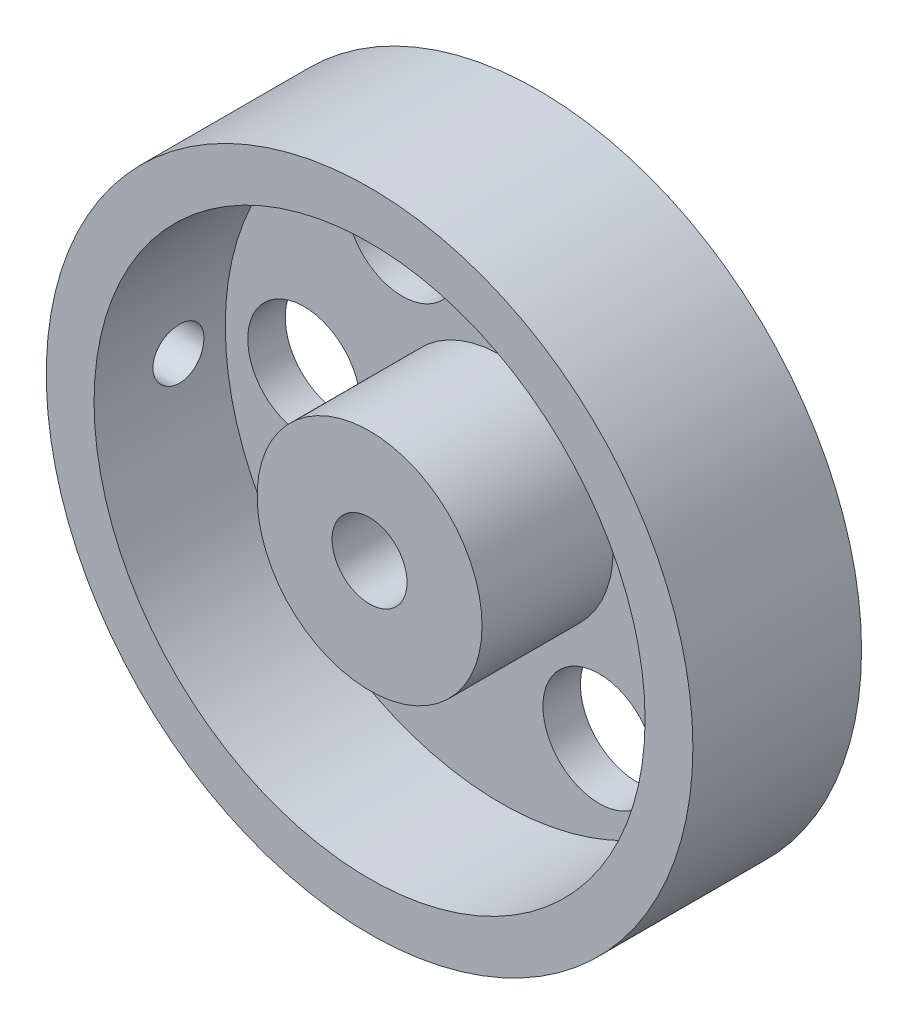
ISO-10303-21;
HEADER;
FILE_DESCRIPTION(('STEP AP214'),'2;1');
FILE_NAME('part.step','',(''),(''),'','','');
FILE_SCHEMA(('AUTOMOTIVE_DESIGN { 1 0 10303 214 1 1 1 1 }'));
ENDSEC;
DATA;
#1=APPLICATION_CONTEXT('core data for automotive mechanical design processes');
#2=APPLICATION_PROTOCOL_DEFINITION('international standard','automotive_design',2000,#1);
#3=PRODUCT_CONTEXT('',#1,'mechanical');
#4=PRODUCT('Part','Part','',(#3));
#5=PRODUCT_RELATED_PRODUCT_CATEGORY('part','',(#4));
#6=PRODUCT_DEFINITION_FORMATION('','',#4);
#7=PRODUCT_DEFINITION_CONTEXT('part definition',#1,'design');
#8=PRODUCT_DEFINITION('design','',#6,#7);
#9=PRODUCT_DEFINITION_SHAPE('','',#8);
#10=(LENGTH_UNIT() NAMED_UNIT(*) SI_UNIT(.MILLI.,.METRE.));
#11=(NAMED_UNIT(*) PLANE_ANGLE_UNIT() SI_UNIT($,.RADIAN.));
#12=(NAMED_UNIT(*) SI_UNIT($,.STERADIAN.) SOLID_ANGLE_UNIT());
#13=UNCERTAINTY_MEASURE_WITH_UNIT(LENGTH_MEASURE(1.E-05),#10,'distance_accuracy_value','');
#14=(GEOMETRIC_REPRESENTATION_CONTEXT(3) GLOBAL_UNCERTAINTY_ASSIGNED_CONTEXT((#13)) GLOBAL_UNIT_ASSIGNED_CONTEXT((#10,
#11,#12)) REPRESENTATION_CONTEXT('',''));
#15=CARTESIAN_POINT('',(0.,0.,0.));
#16=DIRECTION('',(0.,0.,1.));
#17=DIRECTION('',(1.,0.,0.));
#18=AXIS2_PLACEMENT_3D('',#15,#16,#17);
#19=CARTESIAN_POINT('',(0.,0.,4.5));
#20=DIRECTION('',(0.,0.,1.));
#21=DIRECTION('',(1.,0.,0.));
#22=AXIS2_PLACEMENT_3D('',#19,#20,#21);
#23=PLANE('',#22);
#24=CARTESIAN_POINT('',(0.,0.,4.5));
#25=DIRECTION('',(0.,0.,1.));
#26=DIRECTION('',(1.,0.,0.));
#27=AXIS2_PLACEMENT_3D('',#24,#25,#26);
#28=CIRCLE('',#27,2.);
#29=CARTESIAN_POINT('',(2.,0.,4.5));
#30=VERTEX_POINT('',#29);
#31=EDGE_CURVE('E52',#30,#30,#28,.T.);
#32=ORIENTED_EDGE('',*,*,#31,.F.);
#33=EDGE_LOOP('',(#32));
#34=FACE_BOUND('',#33,.T.);
#35=CARTESIAN_POINT('',(0.,0.,4.5));
#36=DIRECTION('',(0.,0.,1.));
#37=DIRECTION('',(1.,0.,0.));
#38=AXIS2_PLACEMENT_3D('',#35,#36,#37);
#39=CIRCLE('',#38,6.);
#40=CARTESIAN_POINT('',(6.,0.,4.5));
#41=VERTEX_POINT('',#40);
#42=EDGE_CURVE('E64',#41,#41,#39,.T.);
#43=ORIENTED_EDGE('',*,*,#42,.T.);
#44=EDGE_LOOP('',(#43));
#45=FACE_BOUND('',#44,.T.);
#46=ADVANCED_FACE('F31',(#34,#45),#23,.T.);
#47=CARTESIAN_POINT('',(0.,0.,4.5));
#48=DIRECTION('',(0.,0.,-1.));
#49=DIRECTION('',(-1.,0.,0.));
#50=AXIS2_PLACEMENT_3D('',#47,#48,#49);
#51=CYLINDRICAL_SURFACE('',#50,17.25);
#52=CARTESIAN_POINT('',(-17.25,0.,1.35933312987779));
#53=CARTESIAN_POINT('',(-17.2499992957602,-0.0762274641774041,1.35932979417059));
#54=CARTESIAN_POINT('',(-17.2494893375577,-0.152507179399383,1.35289964419755));
#55=CARTESIAN_POINT('',(-17.2475040430068,-0.302957131739326,1.327342605069));
#56=CARTESIAN_POINT('',(-17.2460276057452,-0.377124862444516,1.30820123624382));
#57=CARTESIAN_POINT('',(-17.242276241251,-0.521150016364087,1.25777781248264));
#58=CARTESIAN_POINT('',(-17.2400017585159,-0.591009813606863,1.22650251490897));
#59=CARTESIAN_POINT('',(-17.2349095538675,-0.724471087288447,1.1527108490239));
#60=CARTESIAN_POINT('',(-17.2320919501703,-0.788073921080153,1.11019692617242));
#61=CARTESIAN_POINT('',(-17.2262225740768,-0.907378876379137,1.01502919501065));
#62=CARTESIAN_POINT('',(-17.2231703372412,-0.963064672135179,0.962354947138997));
#63=CARTESIAN_POINT('',(-17.2171796127248,-1.06481484378408,0.848404810772238));
#64=CARTESIAN_POINT('',(-17.2142411299849,-1.11087880213141,0.787128549180346));
#65=CARTESIAN_POINT('',(-17.2088055219121,-1.19213210115538,0.657616072063306));
#66=CARTESIAN_POINT('',(-17.2063089750258,-1.22730723393552,0.589370916456741));
#67=CARTESIAN_POINT('',(-17.2020450508998,-1.28569360838048,0.447920266605859));
#68=CARTESIAN_POINT('',(-17.2002776620052,-1.30890504127662,0.374714851668963));
#69=CARTESIAN_POINT('',(-17.1976759503448,-1.34265813373688,0.225584229255765));
#70=CARTESIAN_POINT('',(-17.1968396818036,-1.35322621774692,0.149665036988275));
#71=CARTESIAN_POINT('',(-17.1961887021736,-1.36147424260213,-0.00287388425774297));
#72=CARTESIAN_POINT('',(-17.1963739737542,-1.35915440209354,-0.0794936013297088));
#73=CARTESIAN_POINT('',(-17.1977433769619,-1.34171428665528,-0.231077785869114));
#74=CARTESIAN_POINT('',(-17.1989252699997,-1.32662269907245,-0.30604557692854));
#75=CARTESIAN_POINT('',(-17.2021512269936,-1.28411203591114,-0.452380672278425));
#76=CARTESIAN_POINT('',(-17.2041952985876,-1.256692851125,-0.523747944666397));
#77=CARTESIAN_POINT('',(-17.2089178655337,-1.19027309517235,-0.660947753404041));
#78=CARTESIAN_POINT('',(-17.2115970671521,-1.15125961878549,-0.72677401691549));
#79=CARTESIAN_POINT('',(-17.2172873400081,-1.06276804217602,-0.850954650643922));
#80=CARTESIAN_POINT('',(-17.2202984172447,-1.01328975277884,-0.909308885756894));
#81=CARTESIAN_POINT('',(-17.2263231110799,-0.90511199551655,-1.01705582702473));
#82=CARTESIAN_POINT('',(-17.229336712167,-0.846387720784704,-1.06642363142459));
#83=CARTESIAN_POINT('',(-17.235019036056,-0.72147160410892,-1.15460391664355));
#84=CARTESIAN_POINT('',(-17.2376877586584,-0.655279757840774,-1.1934163913504));
#85=CARTESIAN_POINT('',(-17.2423800575149,-0.517291515521989,-1.25938258957727));
#86=CARTESIAN_POINT('',(-17.2444035748714,-0.44549460855685,-1.28653524880777));
#87=CARTESIAN_POINT('',(-17.2475767648891,-0.298341557836255,-1.32839381132144));
#88=CARTESIAN_POINT('',(-17.2487264537661,-0.222985480156663,-1.34309994557803));
#89=CARTESIAN_POINT('',(-17.2500203636614,-0.0710690644728022,-1.35961687240942));
#90=CARTESIAN_POINT('',(-17.2501672671709,0.00548751115963325,-1.36146206878935));
#91=CARTESIAN_POINT('',(-17.2494462113906,0.157821490063054,-1.35229481089871));
#92=CARTESIAN_POINT('',(-17.2485782605519,0.233598899817141,-1.34128246369767));
#93=CARTESIAN_POINT('',(-17.2459268558467,0.382125693739451,-1.30674122685946));
#94=CARTESIAN_POINT('',(-17.244144565613,0.454878799869758,-1.28322824475954));
#95=CARTESIAN_POINT('',(-17.2398647686895,0.59540698654869,-1.22436941012586));
#96=CARTESIAN_POINT('',(-17.2373672518548,0.663181996470341,-1.18902338974984));
#97=CARTESIAN_POINT('',(-17.2319304417961,0.791986911580763,-1.10741509336683));
#98=CARTESIAN_POINT('',(-17.2289902291071,0.85300230835645,-1.06112998047423));
#99=CARTESIAN_POINT('',(-17.2230015881174,0.966409637753478,-0.958990412544724));
#100=CARTESIAN_POINT('',(-17.2199531581356,1.01880143634707,-0.903135808806561));
#101=CARTESIAN_POINT('',(-17.2140837559855,1.11359201659709,-0.783293680276474));
#102=CARTESIAN_POINT('',(-17.2112633032414,1.15596837914113,-0.719288393866536));
#103=CARTESIAN_POINT('',(-17.2061763666753,1.22937154931333,-0.585050387914116));
#104=CARTESIAN_POINT('',(-17.2039098778265,1.26039845993042,-0.514817724888232));
#105=CARTESIAN_POINT('',(-17.2001902796655,1.31018364224473,-0.370198600142288));
#106=CARTESIAN_POINT('',(-17.1987362545834,1.32895573101892,-0.295816919467276));
#107=CARTESIAN_POINT('',(-17.1968030678176,1.35374341932557,-0.144945488959267));
#108=CARTESIAN_POINT('',(-17.1963238896128,1.35975923504184,-0.0684557748739048));
#109=CARTESIAN_POINT('',(-17.1963948571571,1.35886122525985,0.0842376466537328));
#110=CARTESIAN_POINT('',(-17.1969421983353,1.35198262882585,0.160441565068851));
#111=CARTESIAN_POINT('',(-17.1989985774396,1.32556441236062,0.310608404857035));
#112=CARTESIAN_POINT('',(-17.2005076169089,1.30602477201057,0.384571322633475));
#113=CARTESIAN_POINT('',(-17.2043166303647,1.25484783603023,0.528159589144891));
#114=CARTESIAN_POINT('',(-17.2066165697778,1.2232110692046,0.597785127326117));
#115=CARTESIAN_POINT('',(-17.2117482744468,1.14874202042727,0.730742167281753));
#116=CARTESIAN_POINT('',(-17.2145800300505,1.10590994166072,0.794073783256578));
#117=CARTESIAN_POINT('',(-17.2204654643286,1.01013395721175,0.912825302920152));
#118=CARTESIAN_POINT('',(-17.2235197007625,0.95716405498528,0.968224211919493));
#119=CARTESIAN_POINT('',(-17.2295008984463,0.842661377434269,1.06936618967516));
#120=CARTESIAN_POINT('',(-17.2324278286399,0.781126527908648,1.11510691270317));
#121=CARTESIAN_POINT('',(-17.2378293456297,0.651134042663016,1.19568860292222));
#122=CARTESIAN_POINT('',(-17.2403031513824,0.582664763755367,1.23051082222768));
#123=CARTESIAN_POINT('',(-17.2445102856053,0.440879209639169,1.28812054993251));
#124=CARTESIAN_POINT('',(-17.2462444686903,0.367568642196131,1.31092195530409));
#125=CARTESIAN_POINT('',(-17.2483295231062,0.244851352603883,1.33800682030528));
#126=CARTESIAN_POINT('',(-17.2489531166395,0.196234872498846,1.34599362695821));
#127=CARTESIAN_POINT('',(-17.2497885819731,0.0984195225117546,1.3566578525031));
#128=CARTESIAN_POINT('',(-17.250000454733,0.049220653987309,1.35933528376932));
#129=CARTESIAN_POINT('',(-17.25,0.,1.35933312987779));
#130=B_SPLINE_CURVE_WITH_KNOTS('',3,(#52,#53,#54,#55,#56,#57,#58,#59,#60,#61,#62,#63,#64,#65,
#66,#67,#68,#69,#70,#71,#72,#73,#74,#75,#76,#77,#78,#79,#80,#81,#82,#83,#84,#85,#86,#87,#88,#89,
#90,#91,#92,#93,#94,#95,#96,#97,#98,#99,#100,#101,#102,#103,#104,#105,#106,#107,#108,#109,#110,
#111,#112,#113,#114,#115,#116,#117,#118,#119,#120,#121,#122,#123,#124,#125,#126,#127,#128,#129),
.UNSPECIFIED.,.T.,.F.,(4,2,2,2,2,2,2,2,2,2,2,2,2,2,2,2,2,2,2,2,2,2,2,2,2,2,2,2,2,2,2,2,2,2,2,2,
2,2,4),(0.,0.228502689382628,0.457266119460749,0.685902334056701,0.914488839625479,
1.14354008192695,1.37260126198315,1.60196007667915,1.83131522512208,2.06019018198207,
2.28906125594408,2.51741960986144,2.7457799867987,2.97439550218886,3.20301515066193,
3.4322589769094,3.66150293590459,3.89076781548037,4.12002844043441,4.34867554282929,
4.57732074120864,4.80567567380165,5.03403384556551,5.26287302487969,5.49171576047095,
5.72106599893484,5.95041415614208,6.17950327903521,6.40858851946551,6.63704878387301,
6.8655094149214,7.09396006035558,7.32240655989751,7.55144691266388,7.78054282969696,
8.0100299941685,8.23925126905359,8.38679753920168,8.53434346547173),.UNSPECIFIED.);
#131=CARTESIAN_POINT('',(-17.25,0.,1.35933312987779));
#132=VERTEX_POINT('',#131);
#133=EDGE_CURVE('E105',#132,#132,#130,.T.);
#134=ORIENTED_EDGE('',*,*,#133,.T.);
#135=EDGE_LOOP('',(#134));
#136=FACE_BOUND('',#135,.T.);
#137=CARTESIAN_POINT('',(0.,0.,4.5));
#138=DIRECTION('',(0.,0.,1.));
#139=DIRECTION('',(1.,0.,0.));
#140=AXIS2_PLACEMENT_3D('',#137,#138,#139);
#141=CIRCLE('',#140,17.25);
#142=CARTESIAN_POINT('',(17.25,0.,4.5));
#143=VERTEX_POINT('',#142);
#144=EDGE_CURVE('E10',#143,#143,#141,.T.);
#145=ORIENTED_EDGE('',*,*,#144,.F.);
#146=EDGE_LOOP('',(#145));
#147=FACE_BOUND('',#146,.T.);
#148=CARTESIAN_POINT('',(0.,0.,-4.5));
#149=DIRECTION('',(0.,0.,1.));
#150=DIRECTION('',(1.,0.,0.));
#151=AXIS2_PLACEMENT_3D('',#148,#149,#150);
#152=CIRCLE('',#151,17.25);
#153=CARTESIAN_POINT('',(17.25,0.,-4.5));
#154=VERTEX_POINT('',#153);
#155=EDGE_CURVE('E45',#154,#154,#152,.T.);
#156=ORIENTED_EDGE('',*,*,#155,.T.);
#157=EDGE_LOOP('',(#156));
#158=FACE_BOUND('',#157,.T.);
#159=ADVANCED_FACE('F33',(#136,#147,#158),#51,.T.);
#160=CARTESIAN_POINT('',(0.,0.,4.5));
#161=DIRECTION('',(0.,0.,1.));
#162=DIRECTION('',(1.,0.,0.));
#163=AXIS2_PLACEMENT_3D('',#160,#161,#162);
#164=CIRCLE('',#163,14.7);
#165=CARTESIAN_POINT('',(14.7,0.,4.5));
#166=VERTEX_POINT('',#165);
#167=EDGE_CURVE('E58',#166,#166,#164,.T.);
#168=ORIENTED_EDGE('',*,*,#167,.F.);
#169=EDGE_LOOP('',(#168));
#170=FACE_BOUND('',#169,.T.);
#171=ORIENTED_EDGE('',*,*,#144,.T.);
#172=EDGE_LOOP('',(#171));
#173=FACE_BOUND('',#172,.T.);
#174=ADVANCED_FACE('F146',(#170,#173),#23,.T.);
#175=CARTESIAN_POINT('',(0.,0.,-4.5));
#176=DIRECTION('',(0.,0.,1.));
#177=DIRECTION('',(1.,0.,0.));
#178=AXIS2_PLACEMENT_3D('',#175,#176,#177);
#179=PLANE('',#178);
#180=CARTESIAN_POINT('',(5.24999999999998,-9.09326673973662,-4.5));
#181=DIRECTION('',(0.,0.,1.));
#182=DIRECTION('',(1.,0.,0.));
#183=AXIS2_PLACEMENT_3D('',#180,#181,#182);
#184=CIRCLE('',#183,3.);
#185=CARTESIAN_POINT('',(8.24999999999998,-9.09326673973662,-4.5));
#186=VERTEX_POINT('',#185);
#187=EDGE_CURVE('E75',#186,#186,#184,.F.);
#188=ORIENTED_EDGE('',*,*,#187,.F.);
#189=EDGE_LOOP('',(#188));
#190=FACE_BOUND('',#189,.T.);
#191=CARTESIAN_POINT('',(-5.25000000000004,-9.09326673973658,-4.5));
#192=DIRECTION('',(0.,0.,1.));
#193=DIRECTION('',(1.,0.,0.));
#194=AXIS2_PLACEMENT_3D('',#191,#192,#193);
#195=CIRCLE('',#194,3.);
#196=CARTESIAN_POINT('',(-2.25000000000004,-9.09326673973658,-4.5));
#197=VERTEX_POINT('',#196);
#198=EDGE_CURVE('E90',#197,#197,#195,.F.);
#199=ORIENTED_EDGE('',*,*,#198,.F.);
#200=EDGE_LOOP('',(#199));
#201=FACE_BOUND('',#200,.T.);
#202=CARTESIAN_POINT('',(-10.5,0.,-4.5));
#203=DIRECTION('',(0.,0.,1.));
#204=DIRECTION('',(1.,0.,0.));
#205=AXIS2_PLACEMENT_3D('',#202,#203,#204);
#206=CIRCLE('',#205,3.);
#207=CARTESIAN_POINT('',(-7.5,0.,-4.5));
#208=VERTEX_POINT('',#207);
#209=EDGE_CURVE('E84',#208,#208,#206,.F.);
#210=ORIENTED_EDGE('',*,*,#209,.F.);
#211=EDGE_LOOP('',(#210));
#212=FACE_BOUND('',#211,.T.);
#213=CARTESIAN_POINT('',(-5.24999999999992,9.09326673973665,-4.5));
#214=DIRECTION('',(0.,0.,1.));
#215=DIRECTION('',(1.,0.,0.));
#216=AXIS2_PLACEMENT_3D('',#213,#214,#215);
#217=CIRCLE('',#216,3.);
#218=CARTESIAN_POINT('',(-2.24999999999992,9.09326673973665,-4.5));
#219=VERTEX_POINT('',#218);
#220=EDGE_CURVE('E76',#219,#219,#217,.F.);
#221=ORIENTED_EDGE('',*,*,#220,.F.);
#222=EDGE_LOOP('',(#221));
#223=FACE_BOUND('',#222,.T.);
#224=CARTESIAN_POINT('',(5.25000000000011,9.09326673973655,-4.5));
#225=DIRECTION('',(0.,0.,1.));
#226=DIRECTION('',(1.,0.,0.));
#227=AXIS2_PLACEMENT_3D('',#224,#225,#226);
#228=CIRCLE('',#227,3.);
#229=CARTESIAN_POINT('',(8.2500000000001,9.09326673973655,-4.5));
#230=VERTEX_POINT('',#229);
#231=EDGE_CURVE('E83',#230,#230,#228,.F.);
#232=ORIENTED_EDGE('',*,*,#231,.F.);
#233=EDGE_LOOP('',(#232));
#234=FACE_BOUND('',#233,.T.);
#235=CARTESIAN_POINT('',(10.5,0.,-4.5));
#236=DIRECTION('',(0.,0.,1.));
#237=DIRECTION('',(1.,0.,0.));
#238=AXIS2_PLACEMENT_3D('',#235,#236,#237);
#239=CIRCLE('',#238,3.);
#240=CARTESIAN_POINT('',(13.5,0.,-4.5));
#241=VERTEX_POINT('',#240);
#242=EDGE_CURVE('E67',#241,#241,#239,.F.);
#243=ORIENTED_EDGE('',*,*,#242,.F.);
#244=EDGE_LOOP('',(#243));
#245=FACE_BOUND('',#244,.T.);
#246=CARTESIAN_POINT('',(0.,0.,-4.5));
#247=DIRECTION('',(0.,0.,1.));
#248=DIRECTION('',(1.,0.,0.));
#249=AXIS2_PLACEMENT_3D('',#246,#247,#248);
#250=CIRCLE('',#249,2.);
#251=CARTESIAN_POINT('',(2.,0.,-4.5));
#252=VERTEX_POINT('',#251);
#253=EDGE_CURVE('E50',#252,#252,#250,.T.);
#254=ORIENTED_EDGE('',*,*,#253,.T.);
#255=EDGE_LOOP('',(#254));
#256=FACE_BOUND('',#255,.T.);
#257=ORIENTED_EDGE('',*,*,#155,.F.);
#258=EDGE_LOOP('',(#257));
#259=FACE_BOUND('',#258,.T.);
#260=ADVANCED_FACE('F144',(#190,#201,#212,#223,#234,#245,#256,#259),#179,.F.);
#261=CARTESIAN_POINT('',(0.,0.,-4.5));
#262=DIRECTION('',(0.,0.,1.));
#263=DIRECTION('',(1.,0.,0.));
#264=AXIS2_PLACEMENT_3D('',#261,#262,#263);
#265=CYLINDRICAL_SURFACE('',#264,2.);
#266=CARTESIAN_POINT('',(-2.,0.,-1.35933312987779));
#267=CARTESIAN_POINT('',(-1.99999850436739,-0.0680042378719131,-1.35933160545136));
#268=CARTESIAN_POINT('',(-1.99650055032291,-0.136022646043432,-1.35420007943743));
#269=CARTESIAN_POINT('',(-1.98285056613965,-0.26988954315332,-1.3339929079033));
#270=CARTESIAN_POINT('',(-1.97269392570533,-0.335736495433287,-1.31891037252554));
#271=CARTESIAN_POINT('',(-1.94672510082895,-0.46310926435366,-1.27974153745011));
#272=CARTESIAN_POINT('',(-1.93094049464692,-0.524654431977787,-1.25569911761041));
#273=CARTESIAN_POINT('',(-1.89497041174998,-0.64256694272928,-1.19965024561961));
#274=CARTESIAN_POINT('',(-1.87478444244448,-0.698933705296874,-1.16764290199561));
#275=CARTESIAN_POINT('',(-1.82953356265569,-0.810388248367278,-1.09357901082231));
#276=CARTESIAN_POINT('',(-1.80419794301632,-0.864945887047939,-1.05089361275268));
#277=CARTESIAN_POINT('',(-1.75183288482671,-0.966623050552544,-0.958211032991628));
#278=CARTESIAN_POINT('',(-1.72480100435785,-1.01373149176698,-0.908203165249389));
#279=CARTESIAN_POINT('',(-1.6666636372406,-1.10712570030988,-0.792749892245803));
#280=CARTESIAN_POINT('',(-1.63562132020184,-1.15199532175911,-0.726118620168708));
#281=CARTESIAN_POINT('',(-1.57789582219418,-1.22987528172704,-0.584544851845798));
#282=CARTESIAN_POINT('',(-1.55120518969791,-1.26290601112706,-0.509616939723839));
#283=CARTESIAN_POINT('',(-1.51353890890958,-1.30758858002138,-0.37599778430192));
#284=CARTESIAN_POINT('',(-1.50025038575797,-1.32267766158914,-0.319115126927246));
#285=CARTESIAN_POINT('',(-1.4798988919341,-1.34541346551992,-0.202838905047937));
#286=CARTESIAN_POINT('',(-1.4728247222295,-1.35307357840482,-0.143450060344217));
#287=CARTESIAN_POINT('',(-1.46600366852238,-1.36046428414192,-0.023458745210917));
#288=CARTESIAN_POINT('',(-1.46629126782413,-1.36015755938582,0.0371481074892502));
#289=CARTESIAN_POINT('',(-1.4742307147343,-1.35154494342362,0.157314680106961));
#290=CARTESIAN_POINT('',(-1.48188790100805,-1.34323325326931,0.216873609037379));
#291=CARTESIAN_POINT('',(-1.50276527301155,-1.31981893674641,0.330216974757813));
#292=CARTESIAN_POINT('',(-1.51567398865409,-1.30509370637362,0.384140536298551));
#293=CARTESIAN_POINT('',(-1.54551145176362,-1.2696186482731,0.488787026505499));
#294=CARTESIAN_POINT('',(-1.56244331089099,-1.24886415449153,0.539507439100248));
#295=CARTESIAN_POINT('',(-1.60776348621842,-1.19039655790801,0.661266906152939));
#296=CARTESIAN_POINT('',(-1.63770908494003,-1.14935102449044,0.730135514245274));
#297=CARTESIAN_POINT('',(-1.69922728583651,-1.05629076253934,0.859295383568079));
#298=CARTESIAN_POINT('',(-1.73080282347612,-1.00425568166916,0.919570377832566));
#299=CARTESIAN_POINT('',(-1.79252586539451,-0.889459003889289,1.03106831464328));
#300=CARTESIAN_POINT('',(-1.82265871562228,-0.826608819806964,1.0822087590051));
#301=CARTESIAN_POINT('',(-1.87810580922345,-0.691397117040166,1.1731857323221));
#302=CARTESIAN_POINT('',(-1.903429963023,-0.619055691518827,1.2130455949197));
#303=CARTESIAN_POINT('',(-1.9416937991503,-0.483363396960017,1.2721419606765));
#304=CARTESIAN_POINT('',(-1.95613427746884,-0.421572245755249,1.2939911665435));
#305=CARTESIAN_POINT('',(-1.97925364920508,-0.29447375974897,1.32868387283103));
#306=CARTESIAN_POINT('',(-1.98793642490979,-0.229168826397497,1.34153344182981));
#307=CARTESIAN_POINT('',(-1.99877520159137,-0.0966078516488956,1.35754340552353));
#308=CARTESIAN_POINT('',(-2.00090925487339,-0.0293460102444935,1.36067121872061));
#309=CARTESIAN_POINT('',(-1.99837951323136,0.104773785717552,1.35694849025299));
#310=CARTESIAN_POINT('',(-1.99371537003805,0.171631719406945,1.35009743737446));
#311=CARTESIAN_POINT('',(-1.97845812472333,0.299376946511553,1.32745907911567));
#312=CARTESIAN_POINT('',(-1.96819201847723,0.360392938919183,1.3121641274819));
#313=CARTESIAN_POINT('',(-1.94278474094182,0.478809532931412,1.27373715533336));
#314=CARTESIAN_POINT('',(-1.92764267581807,0.536209469351718,1.2506036978654));
#315=CARTESIAN_POINT('',(-1.89215394184983,0.650877580799853,1.1952080972636));
#316=CARTESIAN_POINT('',(-1.87148571330172,0.707760758744654,1.16235961148235));
#317=CARTESIAN_POINT('',(-1.82713623090032,0.815458110347698,1.08951749837897));
#318=CARTESIAN_POINT('',(-1.80345267515319,0.866267589292261,1.04951840277013));
#319=CARTESIAN_POINT('',(-1.75051417114265,0.969324552526445,0.955940238277058));
#320=CARTESIAN_POINT('',(-1.72099027863053,1.02038875044336,0.901208764672443));
#321=CARTESIAN_POINT('',(-1.66256145876888,1.11305392263674,0.78389318911008));
#322=CARTESIAN_POINT('',(-1.63365680197319,1.15465083392824,0.721305733485454));
#323=CARTESIAN_POINT('',(-1.58343660307185,1.22239557318779,0.598129400456495));
#324=CARTESIAN_POINT('',(-1.56162513474638,1.24989111299219,0.538488006758185));
#325=CARTESIAN_POINT('',(-1.52330922420517,1.29631783071071,0.414384657680265));
#326=CARTESIAN_POINT('',(-1.50679437502618,1.31526583326298,0.34993246587757));
#327=CARTESIAN_POINT('',(-1.48370355217865,1.34122250447041,0.228288642985323));
#328=CARTESIAN_POINT('',(-1.47594273011625,1.34967840373233,0.171636894196055));
#329=CARTESIAN_POINT('',(-1.46705381659122,1.35933826627579,0.0572187929365081));
#330=CARTESIAN_POINT('',(-1.46591989068241,1.36054860870707,-0.000546534141189373));
#331=CARTESIAN_POINT('',(-1.47045675129281,1.35564214663618,-0.11544489289172));
#332=CARTESIAN_POINT('',(-1.47612348332717,1.34952970790734,-0.172578280833736));
#333=CARTESIAN_POINT('',(-1.49339240676692,1.33039106789069,-0.28477376406935));
#334=CARTESIAN_POINT('',(-1.50500291659014,1.31735517615264,-0.339832840077216));
#335=CARTESIAN_POINT('',(-1.53716193270528,1.27981187381968,-0.464027724295882));
#336=CARTESIAN_POINT('',(-1.55938260059748,1.25296654097387,-0.532017054348656));
#337=CARTESIAN_POINT('',(-1.60820902093948,1.18964749172488,-0.661625677542378));
#338=CARTESIAN_POINT('',(-1.63482135683362,1.15315926974224,-0.723235177668369));
#339=CARTESIAN_POINT('',(-1.69007240340884,1.07059487921452,-0.840755102743688));
#340=CARTESIAN_POINT('',(-1.71874110243956,1.02434065076614,-0.896526001069507));
#341=CARTESIAN_POINT('',(-1.77508563916315,0.92326677914543,-1.00030597112273));
#342=CARTESIAN_POINT('',(-1.80276119241296,0.868444705787827,-1.0483128327718));
#343=CARTESIAN_POINT('',(-1.85811557609292,0.74340059182916,-1.14102130217834));
#344=CARTESIAN_POINT('',(-1.88536298340468,0.6721102971398,-1.18456096914911));
#345=CARTESIAN_POINT('',(-1.93260874774388,0.520823912695831,-1.25839919552433));
#346=CARTESIAN_POINT('',(-1.95262262448217,0.44084694602531,-1.28872613224289));
#347=CARTESIAN_POINT('',(-1.9782099996342,0.300232488732926,-1.32711463761108));
#348=CARTESIAN_POINT('',(-1.98632475652869,0.241119721683453,-1.33914384515024));
#349=CARTESIAN_POINT('',(-1.99721915159049,0.121341226912175,-1.35525187529482));
#350=CARTESIAN_POINT('',(-2.0000013344666,0.0606762539170994,-1.35933449003544));
#351=CARTESIAN_POINT('',(-2.,0.,-1.35933312987779));
#352=B_SPLINE_CURVE_WITH_KNOTS('',3,(#266,#267,#268,#269,#270,#271,#272,#273,#274,#275,#276,
#277,#278,#279,#280,#281,#282,#283,#284,#285,#286,#287,#288,#289,#290,#291,#292,#293,#294,#295,
#296,#297,#298,#299,#300,#301,#302,#303,#304,#305,#306,#307,#308,#309,#310,#311,#312,#313,#314,
#315,#316,#317,#318,#319,#320,#321,#322,#323,#324,#325,#326,#327,#328,#329,#330,#331,#332,#333,
#334,#335,#336,#337,#338,#339,#340,#341,#342,#343,#344,#345,#346,#347,#348,#349,#350,#351),
.UNSPECIFIED.,.T.,.F.,(4,2,2,2,2,2,2,2,2,2,2,2,2,2,2,2,2,2,2,2,2,2,2,2,2,2,2,2,2,2,2,2,2,2,2,2,
2,2,2,2,2,2,4),(0.,0.203765449284265,0.407672129497633,0.610593053074672,0.81353669876882,
1.0339937080806,1.25477570855381,1.51195809791215,1.76869537249487,1.9489862712957,
2.12895159313306,2.30976004515736,2.49069957683886,2.66218789660395,2.83380928654711,
3.08922412898047,3.34511620690414,3.60321384127832,3.86077363768372,4.06126279858014,
4.26161663639349,4.46264122012115,4.66367610263071,4.85406679438485,5.04449240741957,
5.25029645786474,5.45625857141425,5.69670121100945,5.93724684531386,6.14410725285572,
6.35055868852059,6.52319514527334,6.69567958666159,6.86806124560129,7.0406848178252,
7.26865367538273,7.49696743283589,7.72987265239008,7.96284405352531,8.22491673585681,
8.48642374956105,8.66831871369145,8.85012685576035),.UNSPECIFIED.);
#353=CARTESIAN_POINT('',(-2.,0.,-1.35933312987779));
#354=VERTEX_POINT('',#353);
#355=EDGE_CURVE('E111',#354,#354,#352,.T.);
#356=ORIENTED_EDGE('',*,*,#355,.T.);
#357=EDGE_LOOP('',(#356));
#358=FACE_BOUND('',#357,.T.);
#359=ORIENTED_EDGE('',*,*,#253,.F.);
#360=EDGE_LOOP('',(#359));
#361=FACE_BOUND('',#360,.T.);
#362=ORIENTED_EDGE('',*,*,#31,.T.);
#363=EDGE_LOOP('',(#362));
#364=FACE_BOUND('',#363,.T.);
#365=ADVANCED_FACE('F139',(#358,#361,#364),#265,.F.);
#366=CARTESIAN_POINT('',(0.,0.,-2.5));
#367=DIRECTION('',(0.,0.,1.));
#368=DIRECTION('',(1.,0.,0.));
#369=AXIS2_PLACEMENT_3D('',#366,#367,#368);
#370=CYLINDRICAL_SURFACE('',#369,14.7);
#371=CARTESIAN_POINT('',(-14.7,0.,-1.35933312987779));
#372=CARTESIAN_POINT('',(-14.699999183283,-0.0761797869430014,-1.35932981702489));
#373=CARTESIAN_POINT('',(-14.6994015182604,-0.152410648848703,-1.35290767370945));
#374=CARTESIAN_POINT('',(-14.6970747812458,-0.302760976778387,-1.32738429619499));
#375=CARTESIAN_POINT('',(-14.6953444460437,-0.376877988909099,-1.30826890551237));
#376=CARTESIAN_POINT('',(-14.6909477932626,-0.520801478799483,-1.25791850188328));
#377=CARTESIAN_POINT('',(-14.6882820241763,-0.590610454437221,-1.22669059000003));
#378=CARTESIAN_POINT('',(-14.6823129962282,-0.723980031179125,-1.15301487220356));
#379=CARTESIAN_POINT('',(-14.6790098687101,-0.787541915586003,-1.11056937728824));
#380=CARTESIAN_POINT('',(-14.6721249841287,-0.906826082153328,-1.01552172195113));
#381=CARTESIAN_POINT('',(-14.668542484682,-0.962526289124322,-0.962891908561596));
#382=CARTESIAN_POINT('',(-14.6615088071783,-1.06431638454263,-0.849028345798621));
#383=CARTESIAN_POINT('',(-14.6580576350538,-1.11040583925544,-0.787794208319566));
#384=CARTESIAN_POINT('',(-14.6516696169479,-1.19174281834145,-0.658323977836741));
#385=CARTESIAN_POINT('',(-14.6487337109329,-1.22697061527094,-0.590075441124902));
#386=CARTESIAN_POINT('',(-14.6437175507056,-1.28545830741145,-0.448600225488732));
#387=CARTESIAN_POINT('',(-14.6416372782212,-1.30871845819691,-0.375373652910404));
#388=CARTESIAN_POINT('',(-14.6385744369486,-1.34254574961515,-0.226244482580482));
#389=CARTESIAN_POINT('',(-14.6375887259093,-1.35314923143212,-0.150350193785759));
#390=CARTESIAN_POINT('',(-14.6368167851868,-1.36147449625355,0.002146789539399));
#391=CARTESIAN_POINT('',(-14.6370305282569,-1.35919657187107,0.0787494679386458));
#392=CARTESIAN_POINT('',(-14.6386304816578,-1.34185367669453,0.230238947644196));
#393=CARTESIAN_POINT('',(-14.6400130616944,-1.32682829774574,0.305130325240401));
#394=CARTESIAN_POINT('',(-14.6437892265934,-1.28447856836706,0.451323693805232));
#395=CARTESIAN_POINT('',(-14.6461828233259,-1.25715407353623,0.522625642620317));
#396=CARTESIAN_POINT('',(-14.6517155037159,-1.1909377556065,0.659741746122513));
#397=CARTESIAN_POINT('',(-14.6548557239771,-1.15202827338434,0.725547325114363));
#398=CARTESIAN_POINT('',(-14.661526828099,-1.06375918599609,0.849708897473312));
#399=CARTESIAN_POINT('',(-14.6650577217248,-1.01439931959119,0.908064704552469));
#400=CARTESIAN_POINT('',(-14.6721284971385,-0.906409038502183,1.0159003586089));
#401=CARTESIAN_POINT('',(-14.6756683627052,-0.847744414649221,1.06534595490252));
#402=CARTESIAN_POINT('',(-14.6823456233179,-0.722928943856727,1.15369244783259));
#403=CARTESIAN_POINT('',(-14.6854830180058,-0.656778090256657,1.19259333508726));
#404=CARTESIAN_POINT('',(-14.6910026562956,-0.518844904623844,1.25874442334177));
#405=CARTESIAN_POINT('',(-14.6933847940352,-0.447061784887876,1.28599299125147));
#406=CARTESIAN_POINT('',(-14.6971243796239,-0.299912454293958,1.3280413845649));
#407=CARTESIAN_POINT('',(-14.6984818536661,-0.224546335078928,1.34284152818307));
#408=CARTESIAN_POINT('',(-14.7000157993498,-0.072667111065743,1.35952974124458));
#409=CARTESIAN_POINT('',(-14.700196595861,0.00384075630737903,1.36146509568949));
#410=CARTESIAN_POINT('',(-14.6993683908053,0.156092338464816,1.35249283271183));
#411=CARTESIAN_POINT('',(-14.6983594029476,0.231836062043855,1.34158536327101));
#412=CARTESIAN_POINT('',(-14.6952678280726,0.380273575894507,1.30727628661527));
#413=CARTESIAN_POINT('',(-14.6931871346602,0.452972501866659,1.2838967138643));
#414=CARTESIAN_POINT('',(-14.6881857197518,0.593416140779153,1.22532966900481));
#415=CARTESIAN_POINT('',(-14.6852649820298,0.66116075799249,1.19014196881339));
#416=CARTESIAN_POINT('',(-14.6788997368852,0.789987211711226,1.10883951220006));
#417=CARTESIAN_POINT('',(-14.6754537446871,0.851049289933794,1.0626935662015));
#418=CARTESIAN_POINT('',(-14.668429757818,0.96457759768958,0.96082941041191));
#419=CARTESIAN_POINT('',(-14.664851760321,1.01704364307661,0.905110995609633));
#420=CARTESIAN_POINT('',(-14.6579541099818,1.11205380779716,0.785477756858611));
#421=CARTESIAN_POINT('',(-14.6546352838447,1.15456697726898,0.721538298860734));
#422=CARTESIAN_POINT('',(-14.64864393996,1.22825209649143,0.587400008952861));
#423=CARTESIAN_POINT('',(-14.645971414493,1.2594241816999,0.517201251816358));
#424=CARTESIAN_POINT('',(-14.6415802035162,1.3094900267195,0.372644822359858));
#425=CARTESIAN_POINT('',(-14.6398600684922,1.32840245295648,0.298293660836943));
#426=CARTESIAN_POINT('',(-14.637563745419,1.35347279230738,0.147454475210331));
#427=CARTESIAN_POINT('',(-14.6369875297229,1.35963101367092,0.0709665027953666));
#428=CARTESIAN_POINT('',(-14.63704478905,1.35901420077256,-0.0816675005474891));
#429=CARTESIAN_POINT('',(-14.6376737162734,1.35228778877144,-0.15781373436297));
#430=CARTESIAN_POINT('',(-14.6400607171128,1.32619432929914,-0.307889792690332));
#431=CARTESIAN_POINT('',(-14.6418187922289,1.30682726503525,-0.381819614257643));
#432=CARTESIAN_POINT('',(-14.6462647683722,1.25601517025802,-0.525365528810716));
#433=CARTESIAN_POINT('',(-14.6489525791078,1.22457131255223,-0.594982039910683));
#434=CARTESIAN_POINT('',(-14.6549553543608,1.15050338859803,-0.727956505860508));
#435=CARTESIAN_POINT('',(-14.6582703123769,1.10787943824494,-0.79131452557791));
#436=CARTESIAN_POINT('',(-14.6651688161945,1.01247846936906,-0.91022261849925));
#437=CARTESIAN_POINT('',(-14.6687532898037,0.959665297138307,-0.965743631798243));
#438=CARTESIAN_POINT('',(-14.6757784506064,0.845454347870074,-1.06715806259694));
#439=CARTESIAN_POINT('',(-14.6792191029892,0.784054507965077,-1.11304915995421));
#440=CARTESIAN_POINT('',(-14.6855766091658,0.654268401034142,-1.19397781857622));
#441=CARTESIAN_POINT('',(-14.688492292282,0.58586704025936,-1.22899124573462));
#442=CARTESIAN_POINT('',(-14.6934582065491,0.444174188419144,-1.28698993882367));
#443=CARTESIAN_POINT('',(-14.69550942202,0.37088836977393,-1.30998889213729));
#444=CARTESIAN_POINT('',(-14.697994568704,0.247649386665328,-1.33751270369618));
#445=CARTESIAN_POINT('',(-14.6987431381973,0.198486358711048,-1.34568432825494));
#446=CARTESIAN_POINT('',(-14.6997461198963,0.0995561581354257,-1.35659561469792));
#447=CARTESIAN_POINT('',(-14.7000005337835,0.0497889875704654,-1.35933529506619));
#448=CARTESIAN_POINT('',(-14.7,0.,-1.35933312987779));
#449=B_SPLINE_CURVE_WITH_KNOTS('',3,(#371,#372,#373,#374,#375,#376,#377,#378,#379,#380,#381,
#382,#383,#384,#385,#386,#387,#388,#389,#390,#391,#392,#393,#394,#395,#396,#397,#398,#399,#400,
#401,#402,#403,#404,#405,#406,#407,#408,#409,#410,#411,#412,#413,#414,#415,#416,#417,#418,#419,
#420,#421,#422,#423,#424,#425,#426,#427,#428,#429,#430,#431,#432,#433,#434,#435,#436,#437,#438,
#439,#440,#441,#442,#443,#444,#445,#446,#447,#448),.UNSPECIFIED.,.T.,.F.,(4,2,2,2,2,2,2,2,2,2,2,
2,2,2,2,2,2,2,2,2,2,2,2,2,2,2,2,2,2,2,2,2,2,2,2,2,2,2,4),(0.,0.228357562768233,
0.456970236129008,0.685449085550008,0.913880901390751,1.1429418976318,1.37201322918927,
1.60149819262381,1.83097825510057,2.05979781252525,2.2886121721231,2.51671845644578,
2.7448274189789,2.97328588630737,3.2017500653174,3.4310745465366,3.66039923178862,
3.88975604671624,4.11910699850259,4.34761449414202,4.5761193568241,4.80422185048621,
5.03232875037407,5.26109284307032,5.48986183576293,5.71933303897678,5.94880150129834,
6.1779197515962,6.40703246439181,6.63528228607444,6.86353241098045,7.0917603755493,
7.3199859743497,7.54903677991103,7.77814270764345,8.00775337743635,8.23710189168488,
8.38635054411662,8.53559868867754),.UNSPECIFIED.);
#450=CARTESIAN_POINT('',(-14.7,0.,-1.35933312987779));
#451=VERTEX_POINT('',#450);
#452=EDGE_CURVE('E128',#451,#451,#449,.T.);
#453=ORIENTED_EDGE('',*,*,#452,.T.);
#454=EDGE_LOOP('',(#453));
#455=FACE_BOUND('',#454,.T.);
#456=CARTESIAN_POINT('',(0.,0.,-2.5));
#457=DIRECTION('',(0.,0.,1.));
#458=DIRECTION('',(1.,0.,0.));
#459=AXIS2_PLACEMENT_3D('',#456,#457,#458);
#460=CIRCLE('',#459,14.7);
#461=CARTESIAN_POINT('',(14.7,0.,-2.5));
#462=VERTEX_POINT('',#461);
#463=EDGE_CURVE('E55',#462,#462,#460,.T.);
#464=ORIENTED_EDGE('',*,*,#463,.F.);
#465=EDGE_LOOP('',(#464));
#466=FACE_BOUND('',#465,.T.);
#467=ORIENTED_EDGE('',*,*,#167,.T.);
#468=EDGE_LOOP('',(#467));
#469=FACE_BOUND('',#468,.T.);
#470=ADVANCED_FACE('F134',(#455,#466,#469),#370,.F.);
#471=CARTESIAN_POINT('',(0.,0.,-2.5));
#472=DIRECTION('',(0.,0.,1.));
#473=DIRECTION('',(1.,0.,0.));
#474=AXIS2_PLACEMENT_3D('',#471,#472,#473);
#475=PLANE('',#474);
#476=CARTESIAN_POINT('',(5.24999999999998,-9.09326673973662,-2.5));
#477=DIRECTION('',(0.,0.,1.));
#478=DIRECTION('',(1.,0.,0.));
#479=AXIS2_PLACEMENT_3D('',#476,#477,#478);
#480=CIRCLE('',#479,3.);
#481=CARTESIAN_POINT('',(8.24999999999998,-9.09326673973662,-2.5));
#482=VERTEX_POINT('',#481);
#483=EDGE_CURVE('E93',#482,#482,#480,.T.);
#484=ORIENTED_EDGE('',*,*,#483,.F.);
#485=EDGE_LOOP('',(#484));
#486=FACE_BOUND('',#485,.T.);
#487=CARTESIAN_POINT('',(-5.25000000000004,-9.09326673973658,-2.5));
#488=DIRECTION('',(0.,0.,1.));
#489=DIRECTION('',(1.,0.,0.));
#490=AXIS2_PLACEMENT_3D('',#487,#488,#489);
#491=CIRCLE('',#490,3.);
#492=CARTESIAN_POINT('',(-2.25000000000004,-9.09326673973658,-2.5));
#493=VERTEX_POINT('',#492);
#494=EDGE_CURVE('E87',#493,#493,#491,.T.);
#495=ORIENTED_EDGE('',*,*,#494,.F.);
#496=EDGE_LOOP('',(#495));
#497=FACE_BOUND('',#496,.T.);
#498=CARTESIAN_POINT('',(-10.5,0.,-2.5));
#499=DIRECTION('',(0.,0.,1.));
#500=DIRECTION('',(1.,0.,0.));
#501=AXIS2_PLACEMENT_3D('',#498,#499,#500);
#502=CIRCLE('',#501,3.);
#503=CARTESIAN_POINT('',(-7.5,0.,-2.5));
#504=VERTEX_POINT('',#503);
#505=EDGE_CURVE('E79',#504,#504,#502,.T.);
#506=ORIENTED_EDGE('',*,*,#505,.F.);
#507=EDGE_LOOP('',(#506));
#508=FACE_BOUND('',#507,.T.);
#509=CARTESIAN_POINT('',(-5.24999999999992,9.09326673973665,-2.5));
#510=DIRECTION('',(0.,0.,1.));
#511=DIRECTION('',(1.,0.,0.));
#512=AXIS2_PLACEMENT_3D('',#509,#510,#511);
#513=CIRCLE('',#512,3.);
#514=CARTESIAN_POINT('',(-2.24999999999992,9.09326673973665,-2.5));
#515=VERTEX_POINT('',#514);
#516=EDGE_CURVE('E80',#515,#515,#513,.T.);
#517=ORIENTED_EDGE('',*,*,#516,.F.);
#518=EDGE_LOOP('',(#517));
#519=FACE_BOUND('',#518,.T.);
#520=CARTESIAN_POINT('',(5.25000000000011,9.09326673973655,-2.5));
#521=DIRECTION('',(0.,0.,1.));
#522=DIRECTION('',(1.,0.,0.));
#523=AXIS2_PLACEMENT_3D('',#520,#521,#522);
#524=CIRCLE('',#523,3.);
#525=CARTESIAN_POINT('',(8.2500000000001,9.09326673973655,-2.5));
#526=VERTEX_POINT('',#525);
#527=EDGE_CURVE('E102',#526,#526,#524,.T.);
#528=ORIENTED_EDGE('',*,*,#527,.F.);
#529=EDGE_LOOP('',(#528));
#530=FACE_BOUND('',#529,.T.);
#531=CARTESIAN_POINT('',(10.5,0.,-2.5));
#532=DIRECTION('',(0.,0.,1.));
#533=DIRECTION('',(1.,0.,0.));
#534=AXIS2_PLACEMENT_3D('',#531,#532,#533);
#535=CIRCLE('',#534,3.);
#536=CARTESIAN_POINT('',(13.5,0.,-2.5));
#537=VERTEX_POINT('',#536);
#538=EDGE_CURVE('E72',#537,#537,#535,.T.);
#539=ORIENTED_EDGE('',*,*,#538,.F.);
#540=EDGE_LOOP('',(#539));
#541=FACE_BOUND('',#540,.T.);
#542=CARTESIAN_POINT('',(0.,0.,-2.5));
#543=DIRECTION('',(0.,0.,1.));
#544=DIRECTION('',(1.,0.,0.));
#545=AXIS2_PLACEMENT_3D('',#542,#543,#544);
#546=CIRCLE('',#545,6.);
#547=CARTESIAN_POINT('',(6.,0.,-2.5));
#548=VERTEX_POINT('',#547);
#549=EDGE_CURVE('E61',#548,#548,#546,.T.);
#550=ORIENTED_EDGE('',*,*,#549,.F.);
#551=EDGE_LOOP('',(#550));
#552=FACE_BOUND('',#551,.T.);
#553=ORIENTED_EDGE('',*,*,#463,.T.);
#554=EDGE_LOOP('',(#553));
#555=FACE_BOUND('',#554,.T.);
#556=ADVANCED_FACE('F138',(#486,#497,#508,#519,#530,#541,#552,#555),#475,.T.);
#557=CARTESIAN_POINT('',(0.,0.,-2.5));
#558=DIRECTION('',(0.,0.,1.));
#559=DIRECTION('',(1.,0.,0.));
#560=AXIS2_PLACEMENT_3D('',#557,#558,#559);
#561=CYLINDRICAL_SURFACE('',#560,6.);
#562=CARTESIAN_POINT('',(-6.,0.,-1.35933312987779));
#563=CARTESIAN_POINT('',(-5.99999862442304,-0.0753234068586115,-1.35933065603856));
#564=CARTESIAN_POINT('',(-5.99856724857427,-0.150676133691547,-1.35305127240252));
#565=CARTESIAN_POINT('',(-5.99299555805013,-0.299236603535043,-1.32812846226113));
#566=CARTESIAN_POINT('',(-5.98885340342231,-0.372442854329041,-1.30947663779279));
#567=CARTESIAN_POINT('',(-5.97832075487275,-0.514542300858963,-1.26042677949429));
#568=CARTESIAN_POINT('',(-5.97193269523371,-0.583440071597927,-1.23004145982578));
#569=CARTESIAN_POINT('',(-5.95759549486999,-0.715158080875708,-1.15842856726118));
#570=CARTESIAN_POINT('',(-5.94964637180189,-0.777978388142402,-1.11720111699451));
#571=CARTESIAN_POINT('',(-5.93290364448745,-0.896836854744946,-1.02432671313737));
#572=CARTESIAN_POINT('',(-5.92409893870168,-0.952755935768695,-0.972529355192355));
#573=CARTESIAN_POINT('',(-5.9067145209021,-1.05519149567561,-0.860308156598322));
#574=CARTESIAN_POINT('',(-5.89813483020516,-1.10170708649673,-0.799883502109291));
#575=CARTESIAN_POINT('',(-5.8820618622715,-1.18454886726094,-0.67123197210869));
#576=CARTESIAN_POINT('',(-5.87458278094989,-1.22074675569192,-0.602920547574706));
#577=CARTESIAN_POINT('',(-5.86171783565532,-1.2811021295027,-0.46098658563609));
#578=CARTESIAN_POINT('',(-5.85633170171062,-1.30526116790155,-0.387364734683122));
#579=CARTESIAN_POINT('',(-5.84837582040218,-1.34045646719616,-0.238195881916641));
#580=CARTESIAN_POINT('',(-5.84576070767522,-1.35170436460985,-0.162701286557447));
#581=CARTESIAN_POINT('',(-5.84350682767295,-1.36141644201444,-0.0108548167790785));
#582=CARTESIAN_POINT('',(-5.84386766682834,-1.35988231242671,0.0654969429464931));
#583=CARTESIAN_POINT('',(-5.84748391786477,-1.3442438470788,0.215305677037767));
#584=CARTESIAN_POINT('',(-5.85068237311652,-1.33038684312574,0.288790054991304));
#585=CARTESIAN_POINT('',(-5.85952325035903,-1.29088846983931,0.432363164302213));
#586=CARTESIAN_POINT('',(-5.86516581838473,-1.26524639634633,0.502451692480415));
#587=CARTESIAN_POINT('',(-5.87831434636816,-1.2026826144072,0.637931155130132));
#588=CARTESIAN_POINT('',(-5.88583570375838,-1.16566708859928,0.703277208490958));
#589=CARTESIAN_POINT('',(-5.90188508387616,-1.08147301242533,0.826921340324475));
#590=CARTESIAN_POINT('',(-5.91041325316219,-1.0342929816174,0.885218390189368));
#591=CARTESIAN_POINT('',(-5.92775865063293,-0.929806599344505,0.994532137114244));
#592=CARTESIAN_POINT('',(-5.93657798921491,-0.872290298918655,1.04534803292055));
#593=CARTESIAN_POINT('',(-5.95333185598402,-0.749450702021197,1.13664700781764));
#594=CARTESIAN_POINT('',(-5.96126636579284,-0.68412724344946,1.17712987230883));
#595=CARTESIAN_POINT('',(-5.97538535030335,-0.547272694410171,1.24666889268695));
#596=CARTESIAN_POINT('',(-5.98156555585623,-0.475727004898738,1.27569723946529));
#597=CARTESIAN_POINT('',(-5.99144807023527,-0.328601729260094,1.32126281413974));
#598=CARTESIAN_POINT('',(-5.99515076626823,-0.253022775481227,1.33780199400388));
#599=CARTESIAN_POINT('',(-5.99960542978865,-0.101697435361449,1.35762421752968));
#600=CARTESIAN_POINT('',(-6.00041839742217,-0.0259886982857586,1.36118134703326));
#601=CARTESIAN_POINT('',(-5.99917361113214,0.124941355529913,1.3556835012196));
#602=CARTESIAN_POINT('',(-5.99711606690155,0.200162707470466,1.34662944715849));
#603=CARTESIAN_POINT('',(-5.9904000880236,0.347064021155862,1.31639325382679));
#604=CARTESIAN_POINT('',(-5.98577279492799,0.418775406881887,1.29535625317019));
#605=CARTESIAN_POINT('',(-5.9744358894885,0.557650845798605,1.24191354037869));
#606=CARTESIAN_POINT('',(-5.96772609111193,0.624814492081062,1.20950681253869));
#607=CARTESIAN_POINT('',(-5.95281888291044,0.753811133117861,1.13368308336667));
#608=CARTESIAN_POINT('',(-5.94460049310846,0.815548052056557,1.09010684944199));
#609=CARTESIAN_POINT('',(-5.9276280157436,0.930931331313854,0.993389249862698));
#610=CARTESIAN_POINT('',(-5.91887385328802,0.984576556891545,0.940246544939115));
#611=CARTESIAN_POINT('',(-5.90160360604446,1.0833484491247,0.824642854867598));
#612=CARTESIAN_POINT('',(-5.89309570812073,1.12828467252325,0.762017697502128));
#613=CARTESIAN_POINT('',(-5.87747888260839,1.20700413356336,0.629949408498805));
#614=CARTESIAN_POINT('',(-5.87036989327276,1.24078786351418,0.560506577992008));
#615=CARTESIAN_POINT('',(-5.85842667088381,1.29600757963545,0.417151504229638));
#616=CARTESIAN_POINT('',(-5.85357937709206,1.31751462595419,0.343267775596567));
#617=CARTESIAN_POINT('',(-5.84668699760854,1.34777462313764,0.192810065196719));
#618=CARTESIAN_POINT('',(-5.84464142587352,1.35652978621808,0.116236552418803));
#619=CARTESIAN_POINT('',(-5.84361629514442,1.36093806215281,-0.0355029488580845));
#620=CARTESIAN_POINT('',(-5.84456595129475,1.35689365368737,-0.1106598272155));
#621=CARTESIAN_POINT('',(-5.84926333457605,1.33649763792129,-0.259190929481463));
#622=CARTESIAN_POINT('',(-5.85301102362372,1.32014619812842,-0.332565177638891));
#623=CARTESIAN_POINT('',(-5.86284647608392,1.27575116024226,-0.475186774271357));
#624=CARTESIAN_POINT('',(-5.86892481150663,1.24775463096278,-0.54444946790081));
#625=CARTESIAN_POINT('',(-5.88273974125069,1.18090348500765,-0.67733856118861));
#626=CARTESIAN_POINT('',(-5.8904765226063,1.1420476435029,-0.740964323986989));
#627=CARTESIAN_POINT('',(-5.90694576514132,1.05359077143438,-0.862257668367044));
#628=CARTESIAN_POINT('',(-5.91569614341329,1.00377549805185,-0.919766603514685));
#629=CARTESIAN_POINT('',(-5.9330896349167,0.895244137577667,-1.02570780026058));
#630=CARTESIAN_POINT('',(-5.94173272276579,0.836525986114401,-1.07413795085863));
#631=CARTESIAN_POINT('',(-5.95808302931854,0.710854294041445,-1.16120579462748));
#632=CARTESIAN_POINT('',(-5.96577528425451,0.643796031284957,-1.19969531586897));
#633=CARTESIAN_POINT('',(-5.97920549890312,0.503999299685958,-1.26479492008296));
#634=CARTESIAN_POINT('',(-5.98494504101379,0.431265489120828,-1.29141462732418));
#635=CARTESIAN_POINT('',(-5.99284024003739,0.298752902935098,-1.32746084543528));
#636=CARTESIAN_POINT('',(-5.99550809912692,0.239672450995777,-1.33938945258896));
#637=CARTESIAN_POINT('',(-5.99908848439074,0.120400873165124,-1.35532638274569));
#638=CARTESIAN_POINT('',(-6.00000109956815,0.060209803746124,-1.35933510734243));
#639=CARTESIAN_POINT('',(-6.,0.,-1.35933312987779));
#640=B_SPLINE_CURVE_WITH_KNOTS('',3,(#562,#563,#564,#565,#566,#567,#568,#569,#570,#571,#572,
#573,#574,#575,#576,#577,#578,#579,#580,#581,#582,#583,#584,#585,#586,#587,#588,#589,#590,#591,
#592,#593,#594,#595,#596,#597,#598,#599,#600,#601,#602,#603,#604,#605,#606,#607,#608,#609,#610,
#611,#612,#613,#614,#615,#616,#617,#618,#619,#620,#621,#622,#623,#624,#625,#626,#627,#628,#629,
#630,#631,#632,#633,#634,#635,#636,#637,#638,#639),.UNSPECIFIED.,.T.,.F.,(4,2,2,2,2,2,2,2,2,2,2,
2,2,2,2,2,2,2,2,2,2,2,2,2,2,2,2,2,2,2,2,2,2,2,2,2,2,2,4),(0.,0.225749769605651,
0.451652926956123,0.677311984315081,0.902968489477479,1.13209323732641,1.3612396135314,
1.5931221725802,1.82497481088807,2.05297011980258,2.28093527684668,2.50442570341117,
2.7279294852973,2.95332878512443,3.17876093617579,3.40943483265635,3.64011351945446,
3.87134884874003,4.10254803010249,4.32883678110495,4.55510900241691,4.7786971588437,
5.00230529442027,5.22929808370639,5.45632267585467,5.6878582349138,5.91938357183336,
6.14955483398863,6.37968616093183,6.6044200000099,6.82915078034993,7.05298190467055,
7.2768382852495,7.50553676214752,7.73428835026562,7.9662749669515,8.19807314095521,
8.3785354855414,8.55898867918415),.UNSPECIFIED.);
#641=CARTESIAN_POINT('',(-6.,0.,-1.35933312987779));
#642=VERTEX_POINT('',#641);
#643=EDGE_CURVE('E36',#642,#642,#640,.T.);
#644=ORIENTED_EDGE('',*,*,#643,.F.);
#645=EDGE_LOOP('',(#644));
#646=FACE_BOUND('',#645,.T.);
#647=ORIENTED_EDGE('',*,*,#549,.T.);
#648=EDGE_LOOP('',(#647));
#649=FACE_BOUND('',#648,.T.);
#650=ORIENTED_EDGE('',*,*,#42,.F.);
#651=EDGE_LOOP('',(#650));
#652=FACE_BOUND('',#651,.T.);
#653=ADVANCED_FACE('F165',(#646,#649,#652),#561,.T.);
#654=CARTESIAN_POINT('',(10.5,0.,-4.501));
#655=DIRECTION('',(0.,0.,1.));
#656=DIRECTION('',(1.,0.,0.));
#657=AXIS2_PLACEMENT_3D('',#654,#655,#656);
#658=CYLINDRICAL_SURFACE('',#657,3.);
#659=ORIENTED_EDGE('',*,*,#538,.T.);
#660=EDGE_LOOP('',(#659));
#661=FACE_BOUND('',#660,.T.);
#662=ORIENTED_EDGE('',*,*,#242,.T.);
#663=EDGE_LOOP('',(#662));
#664=FACE_BOUND('',#663,.T.);
#665=ADVANCED_FACE('F167',(#661,#664),#658,.F.);
#666=CARTESIAN_POINT('',(5.25000000000011,9.09326673973655,-4.501));
#667=DIRECTION('',(0.,0.,1.));
#668=DIRECTION('',(1.,0.,0.));
#669=AXIS2_PLACEMENT_3D('',#666,#667,#668);
#670=CYLINDRICAL_SURFACE('',#669,3.);
#671=ORIENTED_EDGE('',*,*,#527,.T.);
#672=EDGE_LOOP('',(#671));
#673=FACE_BOUND('',#672,.T.);
#674=ORIENTED_EDGE('',*,*,#231,.T.);
#675=EDGE_LOOP('',(#674));
#676=FACE_BOUND('',#675,.T.);
#677=ADVANCED_FACE('F123',(#673,#676),#670,.F.);
#678=CARTESIAN_POINT('',(-5.24999999999992,9.09326673973665,-4.501));
#679=DIRECTION('',(0.,0.,1.));
#680=DIRECTION('',(1.,0.,0.));
#681=AXIS2_PLACEMENT_3D('',#678,#679,#680);
#682=CYLINDRICAL_SURFACE('',#681,3.);
#683=ORIENTED_EDGE('',*,*,#516,.T.);
#684=EDGE_LOOP('',(#683));
#685=FACE_BOUND('',#684,.T.);
#686=ORIENTED_EDGE('',*,*,#220,.T.);
#687=EDGE_LOOP('',(#686));
#688=FACE_BOUND('',#687,.T.);
#689=ADVANCED_FACE('F180',(#685,#688),#682,.F.);
#690=CARTESIAN_POINT('',(-10.5,0.,-4.501));
#691=DIRECTION('',(0.,0.,1.));
#692=DIRECTION('',(1.,0.,0.));
#693=AXIS2_PLACEMENT_3D('',#690,#691,#692);
#694=CYLINDRICAL_SURFACE('',#693,3.);
#695=ORIENTED_EDGE('',*,*,#505,.T.);
#696=EDGE_LOOP('',(#695));
#697=FACE_BOUND('',#696,.T.);
#698=ORIENTED_EDGE('',*,*,#209,.T.);
#699=EDGE_LOOP('',(#698));
#700=FACE_BOUND('',#699,.T.);
#701=ADVANCED_FACE('F183',(#697,#700),#694,.F.);
#702=CARTESIAN_POINT('',(-5.25000000000004,-9.09326673973658,-4.501));
#703=DIRECTION('',(0.,0.,1.));
#704=DIRECTION('',(1.,0.,0.));
#705=AXIS2_PLACEMENT_3D('',#702,#703,#704);
#706=CYLINDRICAL_SURFACE('',#705,3.);
#707=ORIENTED_EDGE('',*,*,#494,.T.);
#708=EDGE_LOOP('',(#707));
#709=FACE_BOUND('',#708,.T.);
#710=ORIENTED_EDGE('',*,*,#198,.T.);
#711=EDGE_LOOP('',(#710));
#712=FACE_BOUND('',#711,.T.);
#713=ADVANCED_FACE('F187',(#709,#712),#706,.F.);
#714=CARTESIAN_POINT('',(5.24999999999998,-9.09326673973662,-4.501));
#715=DIRECTION('',(0.,0.,1.));
#716=DIRECTION('',(1.,0.,0.));
#717=AXIS2_PLACEMENT_3D('',#714,#715,#716);
#718=CYLINDRICAL_SURFACE('',#717,3.);
#719=ORIENTED_EDGE('',*,*,#483,.T.);
#720=EDGE_LOOP('',(#719));
#721=FACE_BOUND('',#720,.T.);
#722=ORIENTED_EDGE('',*,*,#187,.T.);
#723=EDGE_LOOP('',(#722));
#724=FACE_BOUND('',#723,.T.);
#725=ADVANCED_FACE('F190',(#721,#724),#718,.F.);
#726=CARTESIAN_POINT('',(-18.,0.,0.));
#727=DIRECTION('',(1.,0.,0.));
#728=DIRECTION('',(0.,0.,-1.));
#729=AXIS2_PLACEMENT_3D('',#726,#727,#728);
#730=CYLINDRICAL_SURFACE('',#729,1.35933312987779);
#731=ORIENTED_EDGE('',*,*,#643,.T.);
#732=EDGE_LOOP('',(#731));
#733=FACE_BOUND('',#732,.T.);
#734=ORIENTED_EDGE('',*,*,#355,.F.);
#735=EDGE_LOOP('',(#734));
#736=FACE_BOUND('',#735,.T.);
#737=ADVANCED_FACE('F121',(#733,#736),#730,.F.);
#738=ORIENTED_EDGE('',*,*,#452,.F.);
#739=EDGE_LOOP('',(#738));
#740=FACE_BOUND('',#739,.T.);
#741=ORIENTED_EDGE('',*,*,#133,.F.);
#742=EDGE_LOOP('',(#741));
#743=FACE_BOUND('',#742,.T.);
#744=ADVANCED_FACE('F117',(#740,#743),#730,.F.);
#745=CLOSED_SHELL('',(#46,#159,#174,#260,#365,#470,#556,#653,#665,#677,#689,#701,#713,#725,#737,#744));
#746=MANIFOLD_SOLID_BREP('B2',#745);
#747=ADVANCED_BREP_SHAPE_REPRESENTATION('',(#18,#746),#14);
#748=SHAPE_DEFINITION_REPRESENTATION(#9,#747);
ENDSEC;
END-ISO-10303-21;
